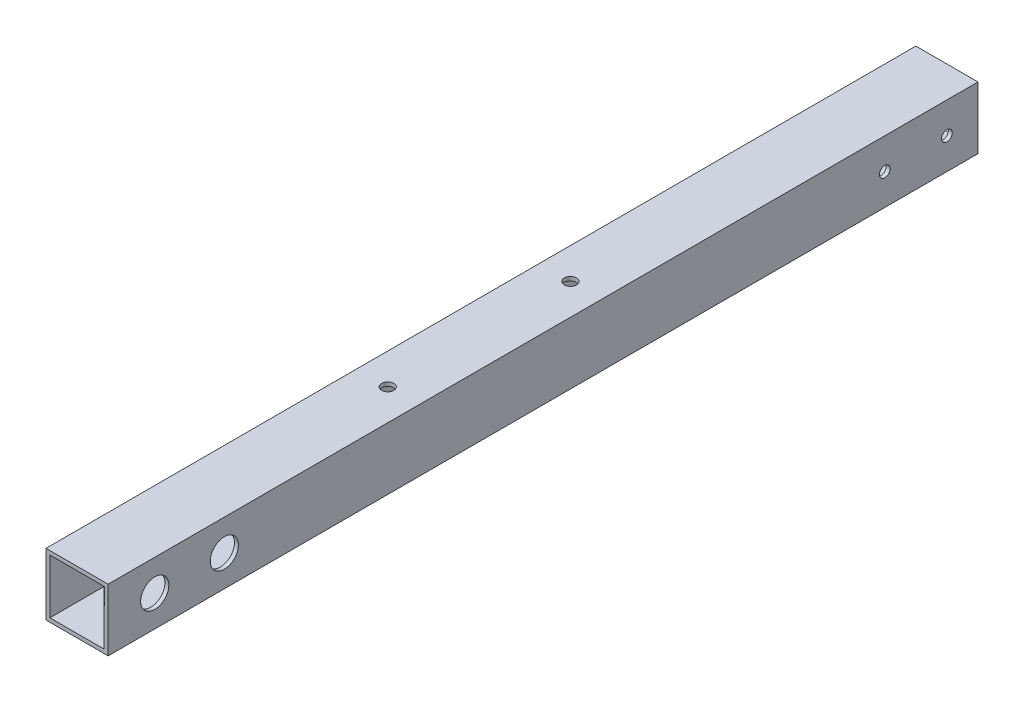
ISO-10303-21;
HEADER;
FILE_DESCRIPTION(('STEP AP214'),'2;1');
FILE_NAME('part.step','',(''),(''),'','','');
FILE_SCHEMA(('AUTOMOTIVE_DESIGN { 1 0 10303 214 1 1 1 1 }'));
ENDSEC;
DATA;
#1=APPLICATION_CONTEXT('core data for automotive mechanical design processes');
#2=APPLICATION_PROTOCOL_DEFINITION('international standard','automotive_design',2000,#1);
#3=PRODUCT_CONTEXT('',#1,'mechanical');
#4=PRODUCT('Part','Part','',(#3));
#5=PRODUCT_RELATED_PRODUCT_CATEGORY('part','',(#4));
#6=PRODUCT_DEFINITION_FORMATION('','',#4);
#7=PRODUCT_DEFINITION_CONTEXT('part definition',#1,'design');
#8=PRODUCT_DEFINITION('design','',#6,#7);
#9=PRODUCT_DEFINITION_SHAPE('','',#8);
#10=(LENGTH_UNIT() NAMED_UNIT(*) SI_UNIT(.MILLI.,.METRE.));
#11=(NAMED_UNIT(*) PLANE_ANGLE_UNIT() SI_UNIT($,.RADIAN.));
#12=(NAMED_UNIT(*) SI_UNIT($,.STERADIAN.) SOLID_ANGLE_UNIT());
#13=UNCERTAINTY_MEASURE_WITH_UNIT(LENGTH_MEASURE(1.E-05),#10,'distance_accuracy_value','');
#14=(GEOMETRIC_REPRESENTATION_CONTEXT(3) GLOBAL_UNCERTAINTY_ASSIGNED_CONTEXT((#13)) GLOBAL_UNIT_ASSIGNED_CONTEXT((#10,
#11,#12)) REPRESENTATION_CONTEXT('',''));
#15=CARTESIAN_POINT('',(0.,0.,0.));
#16=DIRECTION('',(0.,0.,1.));
#17=DIRECTION('',(1.,0.,0.));
#18=AXIS2_PLACEMENT_3D('',#15,#16,#17);
#19=CARTESIAN_POINT('',(0.,0.,355.6));
#20=DIRECTION('',(0.,0.,1.));
#21=DIRECTION('',(1.,0.,0.));
#22=AXIS2_PLACEMENT_3D('',#19,#20,#21);
#23=PLANE('',#22);
#24=DIRECTION('',(0.,1.,0.));
#25=VECTOR('',#24,1.);
#26=CARTESIAN_POINT('',(12.7,12.7,355.6));
#27=LINE('',#26,#25);
#28=CARTESIAN_POINT('',(12.7,-12.7,355.6));
#29=VERTEX_POINT('',#28);
#30=CARTESIAN_POINT('',(12.7,12.7,355.6));
#31=VERTEX_POINT('',#30);
#32=EDGE_CURVE('E140',#29,#31,#27,.T.);
#33=ORIENTED_EDGE('',*,*,#32,.T.);
#34=DIRECTION('',(-1.,0.,0.));
#35=VECTOR('',#34,1.);
#36=CARTESIAN_POINT('',(-12.7,12.7,355.6));
#37=LINE('',#36,#35);
#38=CARTESIAN_POINT('',(-12.7,12.7,355.6));
#39=VERTEX_POINT('',#38);
#40=EDGE_CURVE('E143',#31,#39,#37,.T.);
#41=ORIENTED_EDGE('',*,*,#40,.T.);
#42=DIRECTION('',(0.,-1.,0.));
#43=VECTOR('',#42,1.);
#44=CARTESIAN_POINT('',(-12.7,12.7,355.6));
#45=LINE('',#44,#43);
#46=CARTESIAN_POINT('',(-12.7,-12.7,355.6));
#47=VERTEX_POINT('',#46);
#48=EDGE_CURVE('E146',#39,#47,#45,.T.);
#49=ORIENTED_EDGE('',*,*,#48,.T.);
#50=DIRECTION('',(1.,0.,0.));
#51=VECTOR('',#50,1.);
#52=CARTESIAN_POINT('',(-12.7,-12.7,355.6));
#53=LINE('',#52,#51);
#54=EDGE_CURVE('E148',#47,#29,#53,.T.);
#55=ORIENTED_EDGE('',*,*,#54,.T.);
#56=EDGE_LOOP('',(#33,#41,#49,#55));
#57=FACE_BOUND('',#56,.T.);
#58=DIRECTION('',(-1.,0.,0.));
#59=VECTOR('',#58,1.);
#60=CARTESIAN_POINT('',(-11.1125,11.1125,355.6));
#61=LINE('',#60,#59);
#62=CARTESIAN_POINT('',(11.1125,11.1125,355.6));
#63=VERTEX_POINT('',#62);
#64=CARTESIAN_POINT('',(-11.1125,11.1125,355.6));
#65=VERTEX_POINT('',#64);
#66=EDGE_CURVE('E110',#63,#65,#61,.T.);
#67=ORIENTED_EDGE('',*,*,#66,.F.);
#68=DIRECTION('',(0.,1.,0.));
#69=VECTOR('',#68,1.);
#70=CARTESIAN_POINT('',(11.1125,11.1125,355.6));
#71=LINE('',#70,#69);
#72=CARTESIAN_POINT('',(11.1125,-11.1125,355.6));
#73=VERTEX_POINT('',#72);
#74=EDGE_CURVE('E102',#73,#63,#71,.T.);
#75=ORIENTED_EDGE('',*,*,#74,.F.);
#76=DIRECTION('',(1.,0.,0.));
#77=VECTOR('',#76,1.);
#78=CARTESIAN_POINT('',(-11.1125,-11.1125,355.6));
#79=LINE('',#78,#77);
#80=CARTESIAN_POINT('',(-11.1125,-11.1125,355.6));
#81=VERTEX_POINT('',#80);
#82=EDGE_CURVE('E124',#81,#73,#79,.T.);
#83=ORIENTED_EDGE('',*,*,#82,.F.);
#84=DIRECTION('',(0.,-1.,0.));
#85=VECTOR('',#84,1.);
#86=CARTESIAN_POINT('',(-11.1125,11.1125,355.6));
#87=LINE('',#86,#85);
#88=EDGE_CURVE('E122',#65,#81,#87,.T.);
#89=ORIENTED_EDGE('',*,*,#88,.F.);
#90=EDGE_LOOP('',(#67,#75,#83,#89));
#91=FACE_BOUND('',#90,.T.);
#92=ADVANCED_FACE('F35',(#57,#91),#23,.T.);
#93=CARTESIAN_POINT('',(0.,0.,0.));
#94=DIRECTION('',(0.,0.,1.));
#95=DIRECTION('',(1.,0.,0.));
#96=AXIS2_PLACEMENT_3D('',#93,#94,#95);
#97=PLANE('',#96);
#98=DIRECTION('',(0.,1.,0.));
#99=VECTOR('',#98,1.);
#100=CARTESIAN_POINT('',(12.7,12.7,0.));
#101=LINE('',#100,#99);
#102=CARTESIAN_POINT('',(12.7,-12.7,0.));
#103=VERTEX_POINT('',#102);
#104=CARTESIAN_POINT('',(12.7,12.7,0.));
#105=VERTEX_POINT('',#104);
#106=EDGE_CURVE('E118',#103,#105,#101,.T.);
#107=ORIENTED_EDGE('',*,*,#106,.F.);
#108=DIRECTION('',(1.,0.,0.));
#109=VECTOR('',#108,1.);
#110=CARTESIAN_POINT('',(-12.7,-12.7,0.));
#111=LINE('',#110,#109);
#112=CARTESIAN_POINT('',(-12.7,-12.7,0.));
#113=VERTEX_POINT('',#112);
#114=EDGE_CURVE('E144',#113,#103,#111,.T.);
#115=ORIENTED_EDGE('',*,*,#114,.F.);
#116=DIRECTION('',(0.,-1.,0.));
#117=VECTOR('',#116,1.);
#118=CARTESIAN_POINT('',(-12.7,12.7,0.));
#119=LINE('',#118,#117);
#120=CARTESIAN_POINT('',(-12.7,12.7,0.));
#121=VERTEX_POINT('',#120);
#122=EDGE_CURVE('E155',#121,#113,#119,.T.);
#123=ORIENTED_EDGE('',*,*,#122,.F.);
#124=DIRECTION('',(-1.,0.,0.));
#125=VECTOR('',#124,1.);
#126=CARTESIAN_POINT('',(-12.7,12.7,0.));
#127=LINE('',#126,#125);
#128=EDGE_CURVE('E153',#105,#121,#127,.T.);
#129=ORIENTED_EDGE('',*,*,#128,.F.);
#130=EDGE_LOOP('',(#107,#115,#123,#129));
#131=FACE_BOUND('',#130,.T.);
#132=DIRECTION('',(0.,1.,0.));
#133=VECTOR('',#132,1.);
#134=CARTESIAN_POINT('',(11.1125,11.1125,0.));
#135=LINE('',#134,#133);
#136=CARTESIAN_POINT('',(11.1125,-11.1125,0.));
#137=VERTEX_POINT('',#136);
#138=CARTESIAN_POINT('',(11.1125,11.1125,0.));
#139=VERTEX_POINT('',#138);
#140=EDGE_CURVE('E60',#137,#139,#135,.T.);
#141=ORIENTED_EDGE('',*,*,#140,.T.);
#142=DIRECTION('',(-1.,0.,0.));
#143=VECTOR('',#142,1.);
#144=CARTESIAN_POINT('',(-11.1125,11.1125,0.));
#145=LINE('',#144,#143);
#146=CARTESIAN_POINT('',(-11.1125,11.1125,0.));
#147=VERTEX_POINT('',#146);
#148=EDGE_CURVE('E117',#139,#147,#145,.T.);
#149=ORIENTED_EDGE('',*,*,#148,.T.);
#150=DIRECTION('',(0.,-1.,0.));
#151=VECTOR('',#150,1.);
#152=CARTESIAN_POINT('',(-11.1125,11.1125,0.));
#153=LINE('',#152,#151);
#154=CARTESIAN_POINT('',(-11.1125,-11.1125,0.));
#155=VERTEX_POINT('',#154);
#156=EDGE_CURVE('E132',#147,#155,#153,.T.);
#157=ORIENTED_EDGE('',*,*,#156,.T.);
#158=DIRECTION('',(1.,0.,0.));
#159=VECTOR('',#158,1.);
#160=CARTESIAN_POINT('',(-11.1125,-11.1125,0.));
#161=LINE('',#160,#159);
#162=EDGE_CURVE('E111',#155,#137,#161,.T.);
#163=ORIENTED_EDGE('',*,*,#162,.T.);
#164=EDGE_LOOP('',(#141,#149,#157,#163));
#165=FACE_BOUND('',#164,.T.);
#166=ADVANCED_FACE('F255',(#131,#165),#97,.F.);
#167=CARTESIAN_POINT('',(12.7,12.7,355.6));
#168=DIRECTION('',(-1.,0.,0.));
#169=DIRECTION('',(0.,-1.,0.));
#170=AXIS2_PLACEMENT_3D('',#167,#168,#169);
#171=PLANE('',#170);
#172=CARTESIAN_POINT('',(12.7,0.,12.7));
#173=DIRECTION('',(-1.,0.,0.));
#174=DIRECTION('',(0.,-1.,0.));
#175=AXIS2_PLACEMENT_3D('',#172,#173,#174);
#176=CIRCLE('',#175,2.1828125);
#177=CARTESIAN_POINT('',(12.7,-2.1828125,12.7));
#178=VERTEX_POINT('',#177);
#179=EDGE_CURVE('E197',#178,#178,#176,.F.);
#180=ORIENTED_EDGE('',*,*,#179,.F.);
#181=EDGE_LOOP('',(#180));
#182=FACE_BOUND('',#181,.T.);
#183=CARTESIAN_POINT('',(12.7,0.,38.1));
#184=DIRECTION('',(-1.,0.,0.));
#185=DIRECTION('',(0.,-1.,0.));
#186=AXIS2_PLACEMENT_3D('',#183,#184,#185);
#187=CIRCLE('',#186,2.1828125);
#188=CARTESIAN_POINT('',(12.7,-2.1828125,38.1));
#189=VERTEX_POINT('',#188);
#190=EDGE_CURVE('E208',#189,#189,#187,.F.);
#191=ORIENTED_EDGE('',*,*,#190,.F.);
#192=EDGE_LOOP('',(#191));
#193=FACE_BOUND('',#192,.T.);
#194=CARTESIAN_POINT('',(12.7,0.,336.55));
#195=DIRECTION('',(1.,0.,0.));
#196=DIRECTION('',(0.,1.,0.));
#197=AXIS2_PLACEMENT_3D('',#194,#195,#196);
#198=CIRCLE('',#197,5.75436999999999);
#199=CARTESIAN_POINT('',(12.7,5.75436999999999,336.55));
#200=VERTEX_POINT('',#199);
#201=EDGE_CURVE('E191',#200,#200,#198,.T.);
#202=ORIENTED_EDGE('',*,*,#201,.F.);
#203=EDGE_LOOP('',(#202));
#204=FACE_BOUND('',#203,.T.);
#205=CARTESIAN_POINT('',(12.7,0.,308.102));
#206=DIRECTION('',(1.,0.,0.));
#207=DIRECTION('',(0.,1.,0.));
#208=AXIS2_PLACEMENT_3D('',#205,#206,#207);
#209=CIRCLE('',#208,5.75436999999999);
#210=CARTESIAN_POINT('',(12.7,5.75436999999999,308.102));
#211=VERTEX_POINT('',#210);
#212=EDGE_CURVE('E219',#211,#211,#209,.T.);
#213=ORIENTED_EDGE('',*,*,#212,.F.);
#214=EDGE_LOOP('',(#213));
#215=FACE_BOUND('',#214,.T.);
#216=ORIENTED_EDGE('',*,*,#106,.T.);
#217=DIRECTION('',(0.,0.,-1.));
#218=VECTOR('',#217,1.);
#219=CARTESIAN_POINT('',(12.7,12.7,355.6));
#220=LINE('',#219,#218);
#221=EDGE_CURVE('E11',#31,#105,#220,.T.);
#222=ORIENTED_EDGE('',*,*,#221,.F.);
#223=ORIENTED_EDGE('',*,*,#32,.F.);
#224=DIRECTION('',(0.,0.,-1.));
#225=VECTOR('',#224,1.);
#226=CARTESIAN_POINT('',(12.7,-12.7,355.6));
#227=LINE('',#226,#225);
#228=EDGE_CURVE('E150',#29,#103,#227,.T.);
#229=ORIENTED_EDGE('',*,*,#228,.T.);
#230=EDGE_LOOP('',(#216,#222,#223,#229));
#231=FACE_BOUND('',#230,.T.);
#232=ADVANCED_FACE('F37',(#182,#193,#204,#215,#231),#171,.F.);
#233=CARTESIAN_POINT('',(-12.7,12.7,355.6));
#234=DIRECTION('',(0.,-1.,0.));
#235=DIRECTION('',(0.,0.,-1.));
#236=AXIS2_PLACEMENT_3D('',#233,#234,#235);
#237=PLANE('',#236);
#238=CARTESIAN_POINT('',(0.,12.7,228.6));
#239=DIRECTION('',(0.,1.,0.));
#240=DIRECTION('',(0.,0.,1.));
#241=AXIS2_PLACEMENT_3D('',#238,#239,#240);
#242=CIRCLE('',#241,2.4892);
#243=CARTESIAN_POINT('',(0.,12.7,231.0892));
#244=VERTEX_POINT('',#243);
#245=EDGE_CURVE('E183',#244,#244,#242,.T.);
#246=ORIENTED_EDGE('',*,*,#245,.F.);
#247=EDGE_LOOP('',(#246));
#248=FACE_BOUND('',#247,.T.);
#249=CARTESIAN_POINT('',(0.,12.7,153.924));
#250=DIRECTION('',(0.,1.,0.));
#251=DIRECTION('',(0.,0.,1.));
#252=AXIS2_PLACEMENT_3D('',#249,#250,#251);
#253=CIRCLE('',#252,2.4892);
#254=CARTESIAN_POINT('',(0.,12.7,156.4132));
#255=VERTEX_POINT('',#254);
#256=EDGE_CURVE('E193',#255,#255,#253,.T.);
#257=ORIENTED_EDGE('',*,*,#256,.F.);
#258=EDGE_LOOP('',(#257));
#259=FACE_BOUND('',#258,.T.);
#260=ORIENTED_EDGE('',*,*,#128,.T.);
#261=DIRECTION('',(0.,0.,-1.));
#262=VECTOR('',#261,1.);
#263=CARTESIAN_POINT('',(-12.7,12.7,355.6));
#264=LINE('',#263,#262);
#265=EDGE_CURVE('E44',#39,#121,#264,.T.);
#266=ORIENTED_EDGE('',*,*,#265,.F.);
#267=ORIENTED_EDGE('',*,*,#40,.F.);
#268=ORIENTED_EDGE('',*,*,#221,.T.);
#269=EDGE_LOOP('',(#260,#266,#267,#268));
#270=FACE_BOUND('',#269,.T.);
#271=ADVANCED_FACE('F242',(#248,#259,#270),#237,.F.);
#272=CARTESIAN_POINT('',(-12.7,12.7,355.6));
#273=DIRECTION('',(1.,0.,0.));
#274=DIRECTION('',(0.,1.,0.));
#275=AXIS2_PLACEMENT_3D('',#272,#273,#274);
#276=PLANE('',#275);
#277=CARTESIAN_POINT('',(-12.7,0.,12.7));
#278=DIRECTION('',(-1.,0.,0.));
#279=DIRECTION('',(0.,-1.,0.));
#280=AXIS2_PLACEMENT_3D('',#277,#278,#279);
#281=CIRCLE('',#280,2.1828125);
#282=CARTESIAN_POINT('',(-12.7,-2.1828125,12.7));
#283=VERTEX_POINT('',#282);
#284=EDGE_CURVE('E203',#283,#283,#281,.T.);
#285=ORIENTED_EDGE('',*,*,#284,.F.);
#286=EDGE_LOOP('',(#285));
#287=FACE_BOUND('',#286,.T.);
#288=CARTESIAN_POINT('',(-12.7,0.,38.1));
#289=DIRECTION('',(-1.,0.,0.));
#290=DIRECTION('',(0.,-1.,0.));
#291=AXIS2_PLACEMENT_3D('',#288,#289,#290);
#292=CIRCLE('',#291,2.1828125);
#293=CARTESIAN_POINT('',(-12.7,-2.1828125,38.1));
#294=VERTEX_POINT('',#293);
#295=EDGE_CURVE('E211',#294,#294,#292,.T.);
#296=ORIENTED_EDGE('',*,*,#295,.F.);
#297=EDGE_LOOP('',(#296));
#298=FACE_BOUND('',#297,.T.);
#299=CARTESIAN_POINT('',(-12.7,1.63879969231408E-13,336.55));
#300=DIRECTION('',(-1.,0.,0.));
#301=DIRECTION('',(0.,-1.,0.));
#302=AXIS2_PLACEMENT_3D('',#299,#300,#301);
#303=CIRCLE('',#302,2.48920000000001);
#304=CARTESIAN_POINT('',(-12.7,-2.48919999999984,336.55));
#305=VERTEX_POINT('',#304);
#306=EDGE_CURVE('E168',#305,#305,#303,.T.);
#307=ORIENTED_EDGE('',*,*,#306,.F.);
#308=EDGE_LOOP('',(#307));
#309=FACE_BOUND('',#308,.T.);
#310=CARTESIAN_POINT('',(-12.7,0.,308.102));
#311=DIRECTION('',(-1.,0.,0.));
#312=DIRECTION('',(0.,-1.,0.));
#313=AXIS2_PLACEMENT_3D('',#310,#311,#312);
#314=CIRCLE('',#313,2.48920000000001);
#315=CARTESIAN_POINT('',(-12.7,-2.48920000000001,308.102));
#316=VERTEX_POINT('',#315);
#317=EDGE_CURVE('E178',#316,#316,#314,.T.);
#318=ORIENTED_EDGE('',*,*,#317,.F.);
#319=EDGE_LOOP('',(#318));
#320=FACE_BOUND('',#319,.T.);
#321=ORIENTED_EDGE('',*,*,#122,.T.);
#322=DIRECTION('',(0.,0.,-1.));
#323=VECTOR('',#322,1.);
#324=CARTESIAN_POINT('',(-12.7,-12.7,355.6));
#325=LINE('',#324,#323);
#326=EDGE_CURVE('E160',#47,#113,#325,.T.);
#327=ORIENTED_EDGE('',*,*,#326,.F.);
#328=ORIENTED_EDGE('',*,*,#48,.F.);
#329=ORIENTED_EDGE('',*,*,#265,.T.);
#330=EDGE_LOOP('',(#321,#327,#328,#329));
#331=FACE_BOUND('',#330,.T.);
#332=ADVANCED_FACE('F238',(#287,#298,#309,#320,#331),#276,.F.);
#333=CARTESIAN_POINT('',(-12.7,-12.7,355.6));
#334=DIRECTION('',(0.,1.,0.));
#335=DIRECTION('',(0.,0.,1.));
#336=AXIS2_PLACEMENT_3D('',#333,#334,#335);
#337=PLANE('',#336);
#338=CARTESIAN_POINT('',(0.,-12.7,228.6));
#339=DIRECTION('',(0.,-1.,0.));
#340=DIRECTION('',(0.,0.,-1.));
#341=AXIS2_PLACEMENT_3D('',#338,#339,#340);
#342=CIRCLE('',#341,5.715);
#343=CARTESIAN_POINT('',(0.,-12.7,222.885));
#344=VERTEX_POINT('',#343);
#345=EDGE_CURVE('E175',#344,#344,#342,.T.);
#346=ORIENTED_EDGE('',*,*,#345,.F.);
#347=EDGE_LOOP('',(#346));
#348=FACE_BOUND('',#347,.T.);
#349=CARTESIAN_POINT('',(0.,-12.7,153.924));
#350=DIRECTION('',(0.,-1.,0.));
#351=DIRECTION('',(0.,0.,-1.));
#352=AXIS2_PLACEMENT_3D('',#349,#350,#351);
#353=CIRCLE('',#352,5.715);
#354=CARTESIAN_POINT('',(0.,-12.7,148.209));
#355=VERTEX_POINT('',#354);
#356=EDGE_CURVE('E186',#355,#355,#353,.T.);
#357=ORIENTED_EDGE('',*,*,#356,.F.);
#358=EDGE_LOOP('',(#357));
#359=FACE_BOUND('',#358,.T.);
#360=ORIENTED_EDGE('',*,*,#114,.T.);
#361=ORIENTED_EDGE('',*,*,#228,.F.);
#362=ORIENTED_EDGE('',*,*,#54,.F.);
#363=ORIENTED_EDGE('',*,*,#326,.T.);
#364=EDGE_LOOP('',(#360,#361,#362,#363));
#365=FACE_BOUND('',#364,.T.);
#366=ADVANCED_FACE('F241',(#348,#359,#365),#337,.F.);
#367=CARTESIAN_POINT('',(11.1125,11.1125,355.6));
#368=DIRECTION('',(-1.,0.,0.));
#369=DIRECTION('',(0.,-1.,0.));
#370=AXIS2_PLACEMENT_3D('',#367,#368,#369);
#371=PLANE('',#370);
#372=CARTESIAN_POINT('',(11.1125,0.,12.7));
#373=DIRECTION('',(-1.,0.,0.));
#374=DIRECTION('',(0.,-1.,0.));
#375=AXIS2_PLACEMENT_3D('',#372,#373,#374);
#376=CIRCLE('',#375,2.1828125);
#377=CARTESIAN_POINT('',(11.1125,-2.1828125,12.7));
#378=VERTEX_POINT('',#377);
#379=EDGE_CURVE('E216',#378,#378,#376,.T.);
#380=ORIENTED_EDGE('',*,*,#379,.F.);
#381=EDGE_LOOP('',(#380));
#382=FACE_BOUND('',#381,.T.);
#383=CARTESIAN_POINT('',(11.1125,0.,38.1));
#384=DIRECTION('',(-1.,0.,0.));
#385=DIRECTION('',(0.,-1.,0.));
#386=AXIS2_PLACEMENT_3D('',#383,#384,#385);
#387=CIRCLE('',#386,2.1828125);
#388=CARTESIAN_POINT('',(11.1125,-2.1828125,38.1));
#389=VERTEX_POINT('',#388);
#390=EDGE_CURVE('E196',#389,#389,#387,.T.);
#391=ORIENTED_EDGE('',*,*,#390,.F.);
#392=EDGE_LOOP('',(#391));
#393=FACE_BOUND('',#392,.T.);
#394=CARTESIAN_POINT('',(11.1125,0.,336.55));
#395=DIRECTION('',(-1.,0.,0.));
#396=DIRECTION('',(0.,-1.,0.));
#397=AXIS2_PLACEMENT_3D('',#394,#395,#396);
#398=CIRCLE('',#397,5.75436999999999);
#399=CARTESIAN_POINT('',(11.1125,-5.75436999999999,336.55));
#400=VERTEX_POINT('',#399);
#401=EDGE_CURVE('E190',#400,#400,#398,.T.);
#402=ORIENTED_EDGE('',*,*,#401,.F.);
#403=EDGE_LOOP('',(#402));
#404=FACE_BOUND('',#403,.T.);
#405=CARTESIAN_POINT('',(11.1125,0.,308.102));
#406=DIRECTION('',(-1.,0.,0.));
#407=DIRECTION('',(0.,-1.,0.));
#408=AXIS2_PLACEMENT_3D('',#405,#406,#407);
#409=CIRCLE('',#408,5.75436999999999);
#410=CARTESIAN_POINT('',(11.1125,-5.75436999999999,308.102));
#411=VERTEX_POINT('',#410);
#412=EDGE_CURVE('E187',#411,#411,#409,.T.);
#413=ORIENTED_EDGE('',*,*,#412,.F.);
#414=EDGE_LOOP('',(#413));
#415=FACE_BOUND('',#414,.T.);
#416=ORIENTED_EDGE('',*,*,#140,.F.);
#417=DIRECTION('',(0.,0.,-1.));
#418=VECTOR('',#417,1.);
#419=CARTESIAN_POINT('',(11.1125,-11.1125,355.6));
#420=LINE('',#419,#418);
#421=EDGE_CURVE('E106',#73,#137,#420,.T.);
#422=ORIENTED_EDGE('',*,*,#421,.F.);
#423=ORIENTED_EDGE('',*,*,#74,.T.);
#424=DIRECTION('',(0.,0.,-1.));
#425=VECTOR('',#424,1.);
#426=CARTESIAN_POINT('',(11.1125,11.1125,355.6));
#427=LINE('',#426,#425);
#428=EDGE_CURVE('E105',#63,#139,#427,.T.);
#429=ORIENTED_EDGE('',*,*,#428,.T.);
#430=EDGE_LOOP('',(#416,#422,#423,#429));
#431=FACE_BOUND('',#430,.T.);
#432=ADVANCED_FACE('F104',(#382,#393,#404,#415,#431),#371,.T.);
#433=CARTESIAN_POINT('',(-11.1125,11.1125,355.6));
#434=DIRECTION('',(0.,-1.,0.));
#435=DIRECTION('',(0.,0.,-1.));
#436=AXIS2_PLACEMENT_3D('',#433,#434,#435);
#437=PLANE('',#436);
#438=CARTESIAN_POINT('',(0.,11.1125,228.6));
#439=DIRECTION('',(0.,-1.,0.));
#440=DIRECTION('',(0.,0.,-1.));
#441=AXIS2_PLACEMENT_3D('',#438,#439,#440);
#442=CIRCLE('',#441,2.4892);
#443=CARTESIAN_POINT('',(0.,11.1125,226.1108));
#444=VERTEX_POINT('',#443);
#445=EDGE_CURVE('E182',#444,#444,#442,.T.);
#446=ORIENTED_EDGE('',*,*,#445,.F.);
#447=EDGE_LOOP('',(#446));
#448=FACE_BOUND('',#447,.T.);
#449=CARTESIAN_POINT('',(0.,11.1125,153.924));
#450=DIRECTION('',(0.,-1.,0.));
#451=DIRECTION('',(0.,0.,-1.));
#452=AXIS2_PLACEMENT_3D('',#449,#450,#451);
#453=CIRCLE('',#452,2.4892);
#454=CARTESIAN_POINT('',(0.,11.1125,151.4348));
#455=VERTEX_POINT('',#454);
#456=EDGE_CURVE('E179',#455,#455,#453,.T.);
#457=ORIENTED_EDGE('',*,*,#456,.F.);
#458=EDGE_LOOP('',(#457));
#459=FACE_BOUND('',#458,.T.);
#460=ORIENTED_EDGE('',*,*,#148,.F.);
#461=ORIENTED_EDGE('',*,*,#428,.F.);
#462=ORIENTED_EDGE('',*,*,#66,.T.);
#463=DIRECTION('',(0.,0.,-1.));
#464=VECTOR('',#463,1.);
#465=CARTESIAN_POINT('',(-11.1125,11.1125,355.6));
#466=LINE('',#465,#464);
#467=EDGE_CURVE('E119',#65,#147,#466,.T.);
#468=ORIENTED_EDGE('',*,*,#467,.T.);
#469=EDGE_LOOP('',(#460,#461,#462,#468));
#470=FACE_BOUND('',#469,.T.);
#471=ADVANCED_FACE('F114',(#448,#459,#470),#437,.T.);
#472=CARTESIAN_POINT('',(-11.1125,11.1125,355.6));
#473=DIRECTION('',(1.,0.,0.));
#474=DIRECTION('',(0.,1.,0.));
#475=AXIS2_PLACEMENT_3D('',#472,#473,#474);
#476=PLANE('',#475);
#477=CARTESIAN_POINT('',(-11.1125,0.,12.7));
#478=DIRECTION('',(1.,0.,0.));
#479=DIRECTION('',(0.,1.,0.));
#480=AXIS2_PLACEMENT_3D('',#477,#478,#479);
#481=CIRCLE('',#480,2.1828125);
#482=CARTESIAN_POINT('',(-11.1125,2.1828125,12.7));
#483=VERTEX_POINT('',#482);
#484=EDGE_CURVE('E39',#483,#483,#481,.T.);
#485=ORIENTED_EDGE('',*,*,#484,.F.);
#486=EDGE_LOOP('',(#485));
#487=FACE_BOUND('',#486,.T.);
#488=CARTESIAN_POINT('',(-11.1125,0.,38.1));
#489=DIRECTION('',(1.,0.,0.));
#490=DIRECTION('',(0.,1.,0.));
#491=AXIS2_PLACEMENT_3D('',#488,#489,#490);
#492=CIRCLE('',#491,2.1828125);
#493=CARTESIAN_POINT('',(-11.1125,2.1828125,38.1));
#494=VERTEX_POINT('',#493);
#495=EDGE_CURVE('E194',#494,#494,#492,.T.);
#496=ORIENTED_EDGE('',*,*,#495,.F.);
#497=EDGE_LOOP('',(#496));
#498=FACE_BOUND('',#497,.T.);
#499=CARTESIAN_POINT('',(-11.1125,1.64096809665905E-13,336.55));
#500=DIRECTION('',(1.,0.,0.));
#501=DIRECTION('',(0.,1.,0.));
#502=AXIS2_PLACEMENT_3D('',#499,#500,#501);
#503=CIRCLE('',#502,2.48920000000001);
#504=CARTESIAN_POINT('',(-11.1125,2.48920000000017,336.55));
#505=VERTEX_POINT('',#504);
#506=EDGE_CURVE('E130',#505,#505,#503,.T.);
#507=ORIENTED_EDGE('',*,*,#506,.F.);
#508=EDGE_LOOP('',(#507));
#509=FACE_BOUND('',#508,.T.);
#510=CARTESIAN_POINT('',(-11.1125,0.,308.102));
#511=DIRECTION('',(1.,0.,0.));
#512=DIRECTION('',(0.,1.,0.));
#513=AXIS2_PLACEMENT_3D('',#510,#511,#512);
#514=CIRCLE('',#513,2.48920000000001);
#515=CARTESIAN_POINT('',(-11.1125,2.4892,308.102));
#516=VERTEX_POINT('',#515);
#517=EDGE_CURVE('E165',#516,#516,#514,.T.);
#518=ORIENTED_EDGE('',*,*,#517,.F.);
#519=EDGE_LOOP('',(#518));
#520=FACE_BOUND('',#519,.T.);
#521=ORIENTED_EDGE('',*,*,#156,.F.);
#522=ORIENTED_EDGE('',*,*,#467,.F.);
#523=ORIENTED_EDGE('',*,*,#88,.T.);
#524=DIRECTION('',(0.,0.,-1.));
#525=VECTOR('',#524,1.);
#526=CARTESIAN_POINT('',(-11.1125,-11.1125,355.6));
#527=LINE('',#526,#525);
#528=EDGE_CURVE('E52',#81,#155,#527,.T.);
#529=ORIENTED_EDGE('',*,*,#528,.T.);
#530=EDGE_LOOP('',(#521,#522,#523,#529));
#531=FACE_BOUND('',#530,.T.);
#532=ADVANCED_FACE('F312',(#487,#498,#509,#520,#531),#476,.T.);
#533=CARTESIAN_POINT('',(-11.1125,-11.1125,355.6));
#534=DIRECTION('',(0.,1.,0.));
#535=DIRECTION('',(0.,0.,1.));
#536=AXIS2_PLACEMENT_3D('',#533,#534,#535);
#537=PLANE('',#536);
#538=CARTESIAN_POINT('',(0.,-11.1125,228.6));
#539=DIRECTION('',(0.,1.,0.));
#540=DIRECTION('',(0.,0.,1.));
#541=AXIS2_PLACEMENT_3D('',#538,#539,#540);
#542=CIRCLE('',#541,5.715);
#543=CARTESIAN_POINT('',(0.,-11.1125,234.315));
#544=VERTEX_POINT('',#543);
#545=EDGE_CURVE('E174',#544,#544,#542,.T.);
#546=ORIENTED_EDGE('',*,*,#545,.F.);
#547=EDGE_LOOP('',(#546));
#548=FACE_BOUND('',#547,.T.);
#549=CARTESIAN_POINT('',(0.,-11.1125,153.924));
#550=DIRECTION('',(0.,1.,0.));
#551=DIRECTION('',(0.,0.,1.));
#552=AXIS2_PLACEMENT_3D('',#549,#550,#551);
#553=CIRCLE('',#552,5.715);
#554=CARTESIAN_POINT('',(0.,-11.1125,159.639));
#555=VERTEX_POINT('',#554);
#556=EDGE_CURVE('E171',#555,#555,#553,.T.);
#557=ORIENTED_EDGE('',*,*,#556,.F.);
#558=EDGE_LOOP('',(#557));
#559=FACE_BOUND('',#558,.T.);
#560=ORIENTED_EDGE('',*,*,#162,.F.);
#561=ORIENTED_EDGE('',*,*,#528,.F.);
#562=ORIENTED_EDGE('',*,*,#82,.T.);
#563=ORIENTED_EDGE('',*,*,#421,.T.);
#564=EDGE_LOOP('',(#560,#561,#562,#563));
#565=FACE_BOUND('',#564,.T.);
#566=ADVANCED_FACE('F308',(#548,#559,#565),#537,.T.);
#567=CARTESIAN_POINT('',(-10.16,0.,308.102));
#568=DIRECTION('',(-1.,0.,0.));
#569=DIRECTION('',(0.,-1.,0.));
#570=AXIS2_PLACEMENT_3D('',#567,#568,#569);
#571=CYLINDRICAL_SURFACE('',#570,2.48920000000001);
#572=ORIENTED_EDGE('',*,*,#517,.T.);
#573=EDGE_LOOP('',(#572));
#574=FACE_BOUND('',#573,.T.);
#575=ORIENTED_EDGE('',*,*,#317,.T.);
#576=EDGE_LOOP('',(#575));
#577=FACE_BOUND('',#576,.T.);
#578=ADVANCED_FACE('F236',(#574,#577),#571,.F.);
#579=CARTESIAN_POINT('',(-10.16,1.64226913926603E-13,336.55));
#580=DIRECTION('',(-1.,0.,0.));
#581=DIRECTION('',(0.,-1.,0.));
#582=AXIS2_PLACEMENT_3D('',#579,#580,#581);
#583=CYLINDRICAL_SURFACE('',#582,2.48920000000001);
#584=ORIENTED_EDGE('',*,*,#506,.T.);
#585=EDGE_LOOP('',(#584));
#586=FACE_BOUND('',#585,.T.);
#587=ORIENTED_EDGE('',*,*,#306,.T.);
#588=EDGE_LOOP('',(#587));
#589=FACE_BOUND('',#588,.T.);
#590=ADVANCED_FACE('F292',(#586,#589),#583,.F.);
#591=CARTESIAN_POINT('',(0.,-6.35,153.924));
#592=DIRECTION('',(0.,-1.,0.));
#593=DIRECTION('',(0.,0.,-1.));
#594=AXIS2_PLACEMENT_3D('',#591,#592,#593);
#595=CYLINDRICAL_SURFACE('',#594,5.715);
#596=ORIENTED_EDGE('',*,*,#556,.T.);
#597=EDGE_LOOP('',(#596));
#598=FACE_BOUND('',#597,.T.);
#599=ORIENTED_EDGE('',*,*,#356,.T.);
#600=EDGE_LOOP('',(#599));
#601=FACE_BOUND('',#600,.T.);
#602=ADVANCED_FACE('F289',(#598,#601),#595,.F.);
#603=CARTESIAN_POINT('',(0.,-6.35,228.6));
#604=DIRECTION('',(0.,-1.,0.));
#605=DIRECTION('',(0.,0.,-1.));
#606=AXIS2_PLACEMENT_3D('',#603,#604,#605);
#607=CYLINDRICAL_SURFACE('',#606,5.715);
#608=ORIENTED_EDGE('',*,*,#545,.T.);
#609=EDGE_LOOP('',(#608));
#610=FACE_BOUND('',#609,.T.);
#611=ORIENTED_EDGE('',*,*,#345,.T.);
#612=EDGE_LOOP('',(#611));
#613=FACE_BOUND('',#612,.T.);
#614=ADVANCED_FACE('F291',(#610,#613),#607,.F.);
#615=CARTESIAN_POINT('',(0.,10.16,153.924));
#616=DIRECTION('',(0.,1.,0.));
#617=DIRECTION('',(0.,0.,1.));
#618=AXIS2_PLACEMENT_3D('',#615,#616,#617);
#619=CYLINDRICAL_SURFACE('',#618,2.4892);
#620=ORIENTED_EDGE('',*,*,#456,.T.);
#621=EDGE_LOOP('',(#620));
#622=FACE_BOUND('',#621,.T.);
#623=ORIENTED_EDGE('',*,*,#256,.T.);
#624=EDGE_LOOP('',(#623));
#625=FACE_BOUND('',#624,.T.);
#626=ADVANCED_FACE('F299',(#622,#625),#619,.F.);
#627=CARTESIAN_POINT('',(0.,10.16,228.6));
#628=DIRECTION('',(0.,1.,0.));
#629=DIRECTION('',(0.,0.,1.));
#630=AXIS2_PLACEMENT_3D('',#627,#628,#629);
#631=CYLINDRICAL_SURFACE('',#630,2.4892);
#632=ORIENTED_EDGE('',*,*,#445,.T.);
#633=EDGE_LOOP('',(#632));
#634=FACE_BOUND('',#633,.T.);
#635=ORIENTED_EDGE('',*,*,#245,.T.);
#636=EDGE_LOOP('',(#635));
#637=FACE_BOUND('',#636,.T.);
#638=ADVANCED_FACE('F326',(#634,#637),#631,.F.);
#639=CARTESIAN_POINT('',(10.16,0.,308.102));
#640=DIRECTION('',(1.,0.,0.));
#641=DIRECTION('',(0.,1.,0.));
#642=AXIS2_PLACEMENT_3D('',#639,#640,#641);
#643=CYLINDRICAL_SURFACE('',#642,5.75436999999999);
#644=ORIENTED_EDGE('',*,*,#412,.T.);
#645=EDGE_LOOP('',(#644));
#646=FACE_BOUND('',#645,.T.);
#647=ORIENTED_EDGE('',*,*,#212,.T.);
#648=EDGE_LOOP('',(#647));
#649=FACE_BOUND('',#648,.T.);
#650=ADVANCED_FACE('F331',(#646,#649),#643,.F.);
#651=CARTESIAN_POINT('',(10.16,0.,336.55));
#652=DIRECTION('',(1.,0.,0.));
#653=DIRECTION('',(0.,1.,0.));
#654=AXIS2_PLACEMENT_3D('',#651,#652,#653);
#655=CYLINDRICAL_SURFACE('',#654,5.75436999999999);
#656=ORIENTED_EDGE('',*,*,#401,.T.);
#657=EDGE_LOOP('',(#656));
#658=FACE_BOUND('',#657,.T.);
#659=ORIENTED_EDGE('',*,*,#201,.T.);
#660=EDGE_LOOP('',(#659));
#661=FACE_BOUND('',#660,.T.);
#662=ADVANCED_FACE('F337',(#658,#661),#655,.F.);
#663=CARTESIAN_POINT('',(18.873926083235,0.,38.1));
#664=DIRECTION('',(-1.,0.,0.));
#665=DIRECTION('',(0.,-1.,0.));
#666=AXIS2_PLACEMENT_3D('',#663,#664,#665);
#667=CYLINDRICAL_SURFACE('',#666,2.1828125);
#668=ORIENTED_EDGE('',*,*,#495,.T.);
#669=EDGE_LOOP('',(#668));
#670=FACE_BOUND('',#669,.T.);
#671=ORIENTED_EDGE('',*,*,#295,.T.);
#672=EDGE_LOOP('',(#671));
#673=FACE_BOUND('',#672,.T.);
#674=ADVANCED_FACE('F341',(#670,#673),#667,.F.);
#675=CARTESIAN_POINT('',(18.873926083235,0.,12.7));
#676=DIRECTION('',(-1.,0.,0.));
#677=DIRECTION('',(0.,-1.,0.));
#678=AXIS2_PLACEMENT_3D('',#675,#676,#677);
#679=CYLINDRICAL_SURFACE('',#678,2.1828125);
#680=ORIENTED_EDGE('',*,*,#484,.T.);
#681=EDGE_LOOP('',(#680));
#682=FACE_BOUND('',#681,.T.);
#683=ORIENTED_EDGE('',*,*,#284,.T.);
#684=EDGE_LOOP('',(#683));
#685=FACE_BOUND('',#684,.T.);
#686=ADVANCED_FACE('F345',(#682,#685),#679,.F.);
#687=ORIENTED_EDGE('',*,*,#390,.T.);
#688=EDGE_LOOP('',(#687));
#689=FACE_BOUND('',#688,.T.);
#690=ORIENTED_EDGE('',*,*,#190,.T.);
#691=EDGE_LOOP('',(#690));
#692=FACE_BOUND('',#691,.T.);
#693=ADVANCED_FACE('F346',(#689,#692),#667,.F.);
#694=ORIENTED_EDGE('',*,*,#379,.T.);
#695=EDGE_LOOP('',(#694));
#696=FACE_BOUND('',#695,.T.);
#697=ORIENTED_EDGE('',*,*,#179,.T.);
#698=EDGE_LOOP('',(#697));
#699=FACE_BOUND('',#698,.T.);
#700=ADVANCED_FACE('F349',(#696,#699),#679,.F.);
#701=CLOSED_SHELL('',(#92,#166,#232,#271,#332,#366,#432,#471,#532,#566,#578,#590,#602,#614,#626,
#638,#650,#662,#674,#686,#693,#700));
#702=MANIFOLD_SOLID_BREP('B2',#701);
#703=ADVANCED_BREP_SHAPE_REPRESENTATION('',(#18,#702),#14);
#704=SHAPE_DEFINITION_REPRESENTATION(#9,#703);
ENDSEC;
END-ISO-10303-21;
